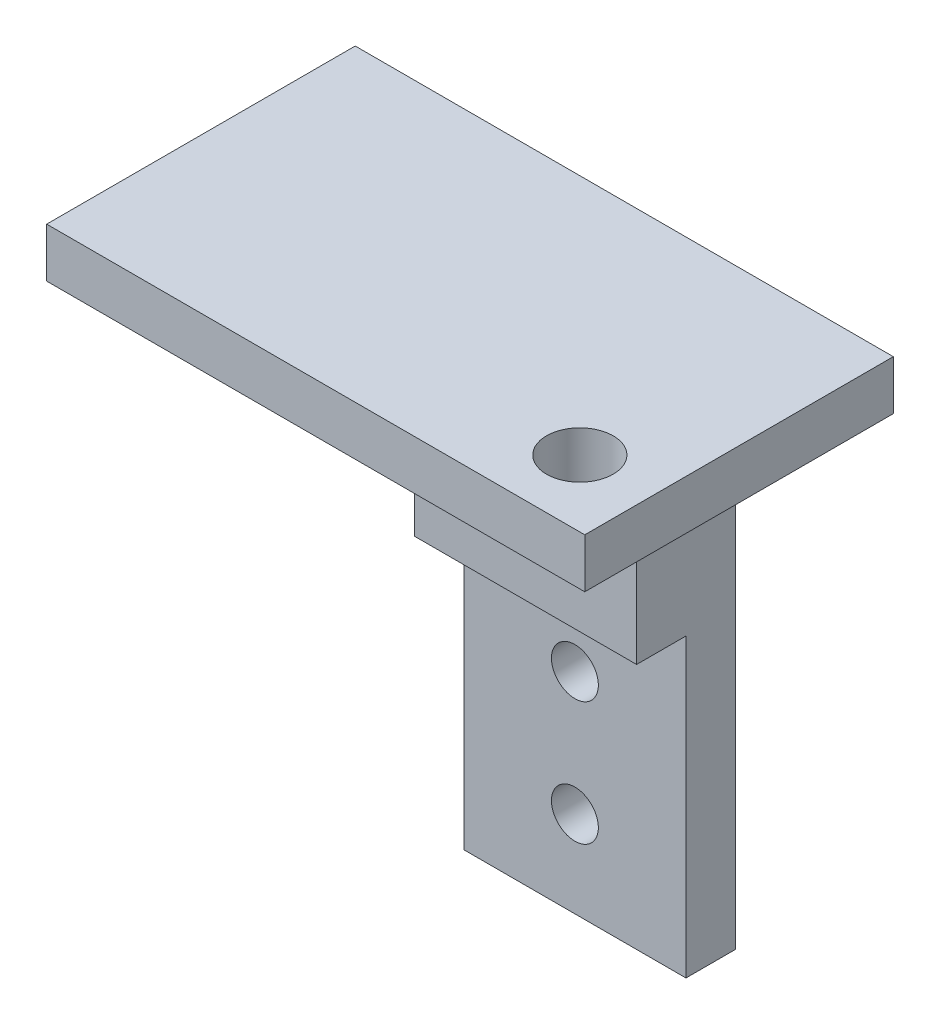
ISO-10303-21;
HEADER;
FILE_DESCRIPTION(('STEP AP214'),'2;1');
FILE_NAME('part.step','',(''),(''),'','','');
FILE_SCHEMA(('AUTOMOTIVE_DESIGN { 1 0 10303 214 1 1 1 1 }'));
ENDSEC;
DATA;
#1=APPLICATION_CONTEXT('core data for automotive mechanical design processes');
#2=APPLICATION_PROTOCOL_DEFINITION('international standard','automotive_design',2000,#1);
#3=PRODUCT_CONTEXT('',#1,'mechanical');
#4=PRODUCT('Part','Part','',(#3));
#5=PRODUCT_RELATED_PRODUCT_CATEGORY('part','',(#4));
#6=PRODUCT_DEFINITION_FORMATION('','',#4);
#7=PRODUCT_DEFINITION_CONTEXT('part definition',#1,'design');
#8=PRODUCT_DEFINITION('design','',#6,#7);
#9=PRODUCT_DEFINITION_SHAPE('','',#8);
#10=(LENGTH_UNIT() NAMED_UNIT(*) SI_UNIT(.MILLI.,.METRE.));
#11=(NAMED_UNIT(*) PLANE_ANGLE_UNIT() SI_UNIT($,.RADIAN.));
#12=(NAMED_UNIT(*) SI_UNIT($,.STERADIAN.) SOLID_ANGLE_UNIT());
#13=UNCERTAINTY_MEASURE_WITH_UNIT(LENGTH_MEASURE(1.E-05),#10,'distance_accuracy_value','');
#14=(GEOMETRIC_REPRESENTATION_CONTEXT(3) GLOBAL_UNCERTAINTY_ASSIGNED_CONTEXT((#13)) GLOBAL_UNIT_ASSIGNED_CONTEXT((#10,
#11,#12)) REPRESENTATION_CONTEXT('',''));
#15=CARTESIAN_POINT('',(0.,0.,0.));
#16=DIRECTION('',(0.,0.,1.));
#17=DIRECTION('',(1.,0.,0.));
#18=AXIS2_PLACEMENT_3D('',#15,#16,#17);
#19=CARTESIAN_POINT('',(0.,0.,0.));
#20=DIRECTION('',(0.,1.,0.));
#21=DIRECTION('',(0.,0.,1.));
#22=AXIS2_PLACEMENT_3D('',#19,#20,#21);
#23=PLANE('',#22);
#24=CARTESIAN_POINT('',(8.,0.,3.55));
#25=DIRECTION('',(0.,1.,0.));
#26=DIRECTION('',(0.,0.,1.));
#27=AXIS2_PLACEMENT_3D('',#24,#25,#26);
#28=CIRCLE('',#27,1.35);
#29=CARTESIAN_POINT('',(8.,0.,4.9));
#30=VERTEX_POINT('',#29);
#31=EDGE_CURVE('E150',#30,#30,#28,.F.);
#32=ORIENTED_EDGE('',*,*,#31,.F.);
#33=EDGE_LOOP('',(#32));
#34=FACE_BOUND('',#33,.T.);
#35=DIRECTION('',(0.,0.,-1.));
#36=VECTOR('',#35,1.);
#37=CARTESIAN_POINT('',(-4.5,0.,-6.25));
#38=LINE('',#37,#36);
#39=CARTESIAN_POINT('',(-4.5,0.,-2.25));
#40=VERTEX_POINT('',#39);
#41=CARTESIAN_POINT('',(-4.5,0.,-6.25));
#42=VERTEX_POINT('',#41);
#43=EDGE_CURVE('E50',#40,#42,#38,.T.);
#44=ORIENTED_EDGE('',*,*,#43,.F.);
#45=DIRECTION('',(-1.,0.,0.));
#46=VECTOR('',#45,1.);
#47=CARTESIAN_POINT('',(-4.5,0.,-2.25));
#48=LINE('',#47,#46);
#49=CARTESIAN_POINT('',(4.5,0.,-2.25));
#50=VERTEX_POINT('',#49);
#51=EDGE_CURVE('E142',#50,#40,#48,.T.);
#52=ORIENTED_EDGE('',*,*,#51,.F.);
#53=DIRECTION('',(0.,0.,1.));
#54=VECTOR('',#53,1.);
#55=CARTESIAN_POINT('',(4.5,0.,-6.25));
#56=LINE('',#55,#54);
#57=CARTESIAN_POINT('',(4.5,0.,-6.25));
#58=VERTEX_POINT('',#57);
#59=EDGE_CURVE('E58',#58,#50,#56,.T.);
#60=ORIENTED_EDGE('',*,*,#59,.F.);
#61=DIRECTION('',(-1.,0.,0.));
#62=VECTOR('',#61,1.);
#63=CARTESIAN_POINT('',(-10.9,0.,-6.25));
#64=LINE('',#63,#62);
#65=CARTESIAN_POINT('',(10.9,0.,-6.25));
#66=VERTEX_POINT('',#65);
#67=EDGE_CURVE('E190',#66,#58,#64,.T.);
#68=ORIENTED_EDGE('',*,*,#67,.F.);
#69=DIRECTION('',(0.,0.,-1.));
#70=VECTOR('',#69,1.);
#71=CARTESIAN_POINT('',(10.9,0.,-6.25));
#72=LINE('',#71,#70);
#73=CARTESIAN_POINT('',(10.9,0.,6.25));
#74=VERTEX_POINT('',#73);
#75=EDGE_CURVE('E175',#74,#66,#72,.T.);
#76=ORIENTED_EDGE('',*,*,#75,.F.);
#77=DIRECTION('',(1.,0.,0.));
#78=VECTOR('',#77,1.);
#79=CARTESIAN_POINT('',(-10.9,0.,6.25));
#80=LINE('',#79,#78);
#81=CARTESIAN_POINT('',(-10.9,0.,6.25));
#82=VERTEX_POINT('',#81);
#83=EDGE_CURVE('E180',#82,#74,#80,.T.);
#84=ORIENTED_EDGE('',*,*,#83,.F.);
#85=DIRECTION('',(0.,0.,1.));
#86=VECTOR('',#85,1.);
#87=CARTESIAN_POINT('',(-10.9,0.,-6.25));
#88=LINE('',#87,#86);
#89=CARTESIAN_POINT('',(-10.9,0.,-6.25));
#90=VERTEX_POINT('',#89);
#91=EDGE_CURVE('E193',#90,#82,#88,.T.);
#92=ORIENTED_EDGE('',*,*,#91,.F.);
#93=EDGE_CURVE('E189',#42,#90,#64,.T.);
#94=ORIENTED_EDGE('',*,*,#93,.F.);
#95=EDGE_LOOP('',(#44,#52,#60,#68,#76,#84,#92,#94));
#96=FACE_BOUND('',#95,.T.);
#97=ADVANCED_FACE('F33',(#34,#96),#23,.F.);
#98=CARTESIAN_POINT('',(-4.5,-22.,-4.25));
#99=DIRECTION('',(0.,0.,-1.));
#100=DIRECTION('',(-1.,0.,0.));
#101=AXIS2_PLACEMENT_3D('',#98,#99,#100);
#102=PLANE('',#101);
#103=CARTESIAN_POINT('',(0.,-18.5,-4.25));
#104=DIRECTION('',(0.,0.,-1.));
#105=DIRECTION('',(-1.,0.,0.));
#106=AXIS2_PLACEMENT_3D('',#103,#104,#105);
#107=CIRCLE('',#106,0.95);
#108=CARTESIAN_POINT('',(-0.95,-18.5,-4.25));
#109=VERTEX_POINT('',#108);
#110=EDGE_CURVE('E157',#109,#109,#107,.T.);
#111=ORIENTED_EDGE('',*,*,#110,.T.);
#112=EDGE_LOOP('',(#111));
#113=FACE_BOUND('',#112,.T.);
#114=CARTESIAN_POINT('',(0.,-13.5,-4.25));
#115=DIRECTION('',(0.,0.,-1.));
#116=DIRECTION('',(-1.,0.,0.));
#117=AXIS2_PLACEMENT_3D('',#114,#115,#116);
#118=CIRCLE('',#117,0.95);
#119=CARTESIAN_POINT('',(-0.95,-13.5,-4.25));
#120=VERTEX_POINT('',#119);
#121=EDGE_CURVE('E37',#120,#120,#118,.T.);
#122=ORIENTED_EDGE('',*,*,#121,.T.);
#123=EDGE_LOOP('',(#122));
#124=FACE_BOUND('',#123,.T.);
#125=DIRECTION('',(1.,0.,0.));
#126=VECTOR('',#125,1.);
#127=CARTESIAN_POINT('',(-4.5,-10.,-4.25));
#128=LINE('',#127,#126);
#129=CARTESIAN_POINT('',(-4.5,-10.,-4.25));
#130=VERTEX_POINT('',#129);
#131=CARTESIAN_POINT('',(4.5,-10.,-4.25));
#132=VERTEX_POINT('',#131);
#133=EDGE_CURVE('E117',#130,#132,#128,.T.);
#134=ORIENTED_EDGE('',*,*,#133,.F.);
#135=DIRECTION('',(0.,1.,0.));
#136=VECTOR('',#135,1.);
#137=CARTESIAN_POINT('',(-4.5,-22.,-4.25));
#138=LINE('',#137,#136);
#139=CARTESIAN_POINT('',(-4.5,-22.,-4.25));
#140=VERTEX_POINT('',#139);
#141=EDGE_CURVE('E123',#140,#130,#138,.T.);
#142=ORIENTED_EDGE('',*,*,#141,.F.);
#143=DIRECTION('',(-1.,0.,0.));
#144=VECTOR('',#143,1.);
#145=CARTESIAN_POINT('',(-4.5,-22.,-4.25));
#146=LINE('',#145,#144);
#147=CARTESIAN_POINT('',(4.5,-22.,-4.25));
#148=VERTEX_POINT('',#147);
#149=EDGE_CURVE('E119',#148,#140,#146,.T.);
#150=ORIENTED_EDGE('',*,*,#149,.F.);
#151=DIRECTION('',(0.,1.,0.));
#152=VECTOR('',#151,1.);
#153=CARTESIAN_POINT('',(4.5,-22.,-4.25));
#154=LINE('',#153,#152);
#155=EDGE_CURVE('E113',#148,#132,#154,.T.);
#156=ORIENTED_EDGE('',*,*,#155,.T.);
#157=EDGE_LOOP('',(#134,#142,#150,#156));
#158=FACE_BOUND('',#157,.T.);
#159=ADVANCED_FACE('F115',(#113,#124,#158),#102,.F.);
#160=CARTESIAN_POINT('',(10.9,2.,-6.25));
#161=DIRECTION('',(-1.,0.,0.));
#162=DIRECTION('',(0.,0.,1.));
#163=AXIS2_PLACEMENT_3D('',#160,#161,#162);
#164=PLANE('',#163);
#165=ORIENTED_EDGE('',*,*,#75,.T.);
#166=DIRECTION('',(0.,-1.,0.));
#167=VECTOR('',#166,1.);
#168=CARTESIAN_POINT('',(10.9,2.,-6.25));
#169=LINE('',#168,#167);
#170=CARTESIAN_POINT('',(10.9,2.,-6.25));
#171=VERTEX_POINT('',#170);
#172=EDGE_CURVE('E11',#171,#66,#169,.T.);
#173=ORIENTED_EDGE('',*,*,#172,.F.);
#174=DIRECTION('',(0.,0.,-1.));
#175=VECTOR('',#174,1.);
#176=CARTESIAN_POINT('',(10.9,2.,-6.25));
#177=LINE('',#176,#175);
#178=CARTESIAN_POINT('',(10.9,2.,6.25));
#179=VERTEX_POINT('',#178);
#180=EDGE_CURVE('E176',#179,#171,#177,.T.);
#181=ORIENTED_EDGE('',*,*,#180,.F.);
#182=DIRECTION('',(0.,-1.,0.));
#183=VECTOR('',#182,1.);
#184=CARTESIAN_POINT('',(10.9,2.,6.25));
#185=LINE('',#184,#183);
#186=EDGE_CURVE('E186',#179,#74,#185,.T.);
#187=ORIENTED_EDGE('',*,*,#186,.T.);
#188=EDGE_LOOP('',(#165,#173,#181,#187));
#189=FACE_BOUND('',#188,.T.);
#190=ADVANCED_FACE('F35',(#189),#164,.F.);
#191=CARTESIAN_POINT('',(-10.9,2.,-6.25));
#192=DIRECTION('',(0.,0.,1.));
#193=DIRECTION('',(1.,0.,0.));
#194=AXIS2_PLACEMENT_3D('',#191,#192,#193);
#195=PLANE('',#194);
#196=CARTESIAN_POINT('',(0.,-13.5,-6.25));
#197=DIRECTION('',(0.,0.,-1.));
#198=DIRECTION('',(-1.,0.,0.));
#199=AXIS2_PLACEMENT_3D('',#196,#197,#198);
#200=CIRCLE('',#199,0.95);
#201=CARTESIAN_POINT('',(-0.95,-13.5,-6.25));
#202=VERTEX_POINT('',#201);
#203=EDGE_CURVE('E154',#202,#202,#200,.T.);
#204=ORIENTED_EDGE('',*,*,#203,.F.);
#205=EDGE_LOOP('',(#204));
#206=FACE_BOUND('',#205,.T.);
#207=CARTESIAN_POINT('',(0.,-18.5,-6.25));
#208=DIRECTION('',(0.,0.,-1.));
#209=DIRECTION('',(-1.,0.,0.));
#210=AXIS2_PLACEMENT_3D('',#207,#208,#209);
#211=CIRCLE('',#210,0.95);
#212=CARTESIAN_POINT('',(-0.95,-18.5,-6.25));
#213=VERTEX_POINT('',#212);
#214=EDGE_CURVE('E153',#213,#213,#211,.T.);
#215=ORIENTED_EDGE('',*,*,#214,.F.);
#216=EDGE_LOOP('',(#215));
#217=FACE_BOUND('',#216,.T.);
#218=ORIENTED_EDGE('',*,*,#67,.T.);
#219=DIRECTION('',(0.,1.,0.));
#220=VECTOR('',#219,1.);
#221=CARTESIAN_POINT('',(4.5,-22.,-6.25));
#222=LINE('',#221,#220);
#223=CARTESIAN_POINT('',(4.5,-22.,-6.25));
#224=VERTEX_POINT('',#223);
#225=EDGE_CURVE('E122',#224,#58,#222,.T.);
#226=ORIENTED_EDGE('',*,*,#225,.F.);
#227=DIRECTION('',(1.,0.,0.));
#228=VECTOR('',#227,1.);
#229=CARTESIAN_POINT('',(-4.5,-22.,-6.25));
#230=LINE('',#229,#228);
#231=CARTESIAN_POINT('',(-4.5,-22.,-6.25));
#232=VERTEX_POINT('',#231);
#233=EDGE_CURVE('E163',#232,#224,#230,.T.);
#234=ORIENTED_EDGE('',*,*,#233,.F.);
#235=DIRECTION('',(0.,1.,0.));
#236=VECTOR('',#235,1.);
#237=CARTESIAN_POINT('',(-4.5,-22.,-6.25));
#238=LINE('',#237,#236);
#239=EDGE_CURVE('E172',#232,#42,#238,.T.);
#240=ORIENTED_EDGE('',*,*,#239,.T.);
#241=ORIENTED_EDGE('',*,*,#93,.T.);
#242=DIRECTION('',(0.,-1.,0.));
#243=VECTOR('',#242,1.);
#244=CARTESIAN_POINT('',(-10.9,2.,-6.25));
#245=LINE('',#244,#243);
#246=CARTESIAN_POINT('',(-10.9,2.,-6.25));
#247=VERTEX_POINT('',#246);
#248=EDGE_CURVE('E42',#247,#90,#245,.T.);
#249=ORIENTED_EDGE('',*,*,#248,.F.);
#250=DIRECTION('',(-1.,0.,0.));
#251=VECTOR('',#250,1.);
#252=CARTESIAN_POINT('',(-10.9,2.,-6.25));
#253=LINE('',#252,#251);
#254=EDGE_CURVE('E179',#171,#247,#253,.T.);
#255=ORIENTED_EDGE('',*,*,#254,.F.);
#256=ORIENTED_EDGE('',*,*,#172,.T.);
#257=EDGE_LOOP('',(#218,#226,#234,#240,#241,#249,#255,#256));
#258=FACE_BOUND('',#257,.T.);
#259=ADVANCED_FACE('F243',(#206,#217,#258),#195,.F.);
#260=CARTESIAN_POINT('',(-10.9,2.,-6.25));
#261=DIRECTION('',(1.,0.,0.));
#262=DIRECTION('',(0.,0.,-1.));
#263=AXIS2_PLACEMENT_3D('',#260,#261,#262);
#264=PLANE('',#263);
#265=ORIENTED_EDGE('',*,*,#91,.T.);
#266=DIRECTION('',(0.,-1.,0.));
#267=VECTOR('',#266,1.);
#268=CARTESIAN_POINT('',(-10.9,2.,6.25));
#269=LINE('',#268,#267);
#270=CARTESIAN_POINT('',(-10.9,2.,6.25));
#271=VERTEX_POINT('',#270);
#272=EDGE_CURVE('E198',#271,#82,#269,.T.);
#273=ORIENTED_EDGE('',*,*,#272,.F.);
#274=DIRECTION('',(0.,0.,1.));
#275=VECTOR('',#274,1.);
#276=CARTESIAN_POINT('',(-10.9,2.,-6.25));
#277=LINE('',#276,#275);
#278=EDGE_CURVE('E182',#247,#271,#277,.T.);
#279=ORIENTED_EDGE('',*,*,#278,.F.);
#280=ORIENTED_EDGE('',*,*,#248,.T.);
#281=EDGE_LOOP('',(#265,#273,#279,#280));
#282=FACE_BOUND('',#281,.T.);
#283=ADVANCED_FACE('F240',(#282),#264,.F.);
#284=CARTESIAN_POINT('',(-10.9,2.,6.25));
#285=DIRECTION('',(0.,0.,-1.));
#286=DIRECTION('',(-1.,0.,0.));
#287=AXIS2_PLACEMENT_3D('',#284,#285,#286);
#288=PLANE('',#287);
#289=ORIENTED_EDGE('',*,*,#83,.T.);
#290=ORIENTED_EDGE('',*,*,#186,.F.);
#291=DIRECTION('',(1.,0.,0.));
#292=VECTOR('',#291,1.);
#293=CARTESIAN_POINT('',(-10.9,2.,6.25));
#294=LINE('',#293,#292);
#295=EDGE_CURVE('E184',#271,#179,#294,.T.);
#296=ORIENTED_EDGE('',*,*,#295,.F.);
#297=ORIENTED_EDGE('',*,*,#272,.T.);
#298=EDGE_LOOP('',(#289,#290,#296,#297));
#299=FACE_BOUND('',#298,.T.);
#300=ADVANCED_FACE('F237',(#299),#288,.F.);
#301=CARTESIAN_POINT('',(0.,2.,0.));
#302=DIRECTION('',(0.,1.,0.));
#303=DIRECTION('',(0.,0.,1.));
#304=AXIS2_PLACEMENT_3D('',#301,#302,#303);
#305=PLANE('',#304);
#306=ORIENTED_EDGE('',*,*,#180,.T.);
#307=ORIENTED_EDGE('',*,*,#254,.T.);
#308=ORIENTED_EDGE('',*,*,#278,.T.);
#309=ORIENTED_EDGE('',*,*,#295,.T.);
#310=EDGE_LOOP('',(#306,#307,#308,#309));
#311=FACE_BOUND('',#310,.T.);
#312=CARTESIAN_POINT('',(8.,2.,3.55));
#313=DIRECTION('',(0.,1.,0.));
#314=DIRECTION('',(0.,0.,1.));
#315=AXIS2_PLACEMENT_3D('',#312,#313,#314);
#316=CIRCLE('',#315,1.35);
#317=CARTESIAN_POINT('',(8.,2.,4.9));
#318=VERTEX_POINT('',#317);
#319=EDGE_CURVE('E147',#318,#318,#316,.T.);
#320=ORIENTED_EDGE('',*,*,#319,.F.);
#321=EDGE_LOOP('',(#320));
#322=FACE_BOUND('',#321,.T.);
#323=ADVANCED_FACE('F235',(#311,#322),#305,.T.);
#324=CARTESIAN_POINT('',(-4.5,-22.,-6.25));
#325=DIRECTION('',(1.,0.,0.));
#326=DIRECTION('',(0.,0.,-1.));
#327=AXIS2_PLACEMENT_3D('',#324,#325,#326);
#328=PLANE('',#327);
#329=ORIENTED_EDGE('',*,*,#43,.T.);
#330=ORIENTED_EDGE('',*,*,#239,.F.);
#331=DIRECTION('',(0.,0.,-1.));
#332=VECTOR('',#331,1.);
#333=CARTESIAN_POINT('',(-4.5,-22.,-6.25));
#334=LINE('',#333,#332);
#335=EDGE_CURVE('E160',#140,#232,#334,.T.);
#336=ORIENTED_EDGE('',*,*,#335,.F.);
#337=ORIENTED_EDGE('',*,*,#141,.T.);
#338=DIRECTION('',(0.,0.,-1.));
#339=VECTOR('',#338,1.);
#340=CARTESIAN_POINT('',(-4.5,-10.,-4.25));
#341=LINE('',#340,#339);
#342=CARTESIAN_POINT('',(-4.5,-10.,-2.25));
#343=VERTEX_POINT('',#342);
#344=EDGE_CURVE('E130',#343,#130,#341,.T.);
#345=ORIENTED_EDGE('',*,*,#344,.F.);
#346=DIRECTION('',(0.,1.,0.));
#347=VECTOR('',#346,1.);
#348=CARTESIAN_POINT('',(-4.5,-10.,-2.25));
#349=LINE('',#348,#347);
#350=EDGE_CURVE('E138',#343,#40,#349,.T.);
#351=ORIENTED_EDGE('',*,*,#350,.T.);
#352=EDGE_LOOP('',(#329,#330,#336,#337,#345,#351));
#353=FACE_BOUND('',#352,.T.);
#354=ADVANCED_FACE('F263',(#353),#328,.F.);
#355=CARTESIAN_POINT('',(4.5,-22.,-6.25));
#356=DIRECTION('',(-1.,0.,0.));
#357=DIRECTION('',(0.,0.,1.));
#358=AXIS2_PLACEMENT_3D('',#355,#356,#357);
#359=PLANE('',#358);
#360=ORIENTED_EDGE('',*,*,#59,.T.);
#361=DIRECTION('',(0.,1.,0.));
#362=VECTOR('',#361,1.);
#363=CARTESIAN_POINT('',(4.5,-10.,-2.25));
#364=LINE('',#363,#362);
#365=CARTESIAN_POINT('',(4.5,-10.,-2.25));
#366=VERTEX_POINT('',#365);
#367=EDGE_CURVE('E134',#366,#50,#364,.T.);
#368=ORIENTED_EDGE('',*,*,#367,.F.);
#369=DIRECTION('',(0.,0.,1.));
#370=VECTOR('',#369,1.);
#371=CARTESIAN_POINT('',(4.5,-10.,-4.25));
#372=LINE('',#371,#370);
#373=EDGE_CURVE('E128',#132,#366,#372,.T.);
#374=ORIENTED_EDGE('',*,*,#373,.F.);
#375=ORIENTED_EDGE('',*,*,#155,.F.);
#376=DIRECTION('',(0.,0.,1.));
#377=VECTOR('',#376,1.);
#378=CARTESIAN_POINT('',(4.5,-22.,-6.25));
#379=LINE('',#378,#377);
#380=EDGE_CURVE('E165',#224,#148,#379,.T.);
#381=ORIENTED_EDGE('',*,*,#380,.F.);
#382=ORIENTED_EDGE('',*,*,#225,.T.);
#383=EDGE_LOOP('',(#360,#368,#374,#375,#381,#382));
#384=FACE_BOUND('',#383,.T.);
#385=ADVANCED_FACE('F132',(#384),#359,.F.);
#386=CARTESIAN_POINT('',(0.,-22.,0.));
#387=DIRECTION('',(0.,1.,0.));
#388=DIRECTION('',(0.,0.,1.));
#389=AXIS2_PLACEMENT_3D('',#386,#387,#388);
#390=PLANE('',#389);
#391=ORIENTED_EDGE('',*,*,#335,.T.);
#392=ORIENTED_EDGE('',*,*,#233,.T.);
#393=ORIENTED_EDGE('',*,*,#380,.T.);
#394=ORIENTED_EDGE('',*,*,#149,.T.);
#395=EDGE_LOOP('',(#391,#392,#393,#394));
#396=FACE_BOUND('',#395,.T.);
#397=ADVANCED_FACE('F222',(#396),#390,.F.);
#398=CARTESIAN_POINT('',(0.,-18.5,6.25));
#399=DIRECTION('',(0.,0.,-1.));
#400=DIRECTION('',(-1.,0.,0.));
#401=AXIS2_PLACEMENT_3D('',#398,#399,#400);
#402=CYLINDRICAL_SURFACE('',#401,0.95);
#403=ORIENTED_EDGE('',*,*,#214,.T.);
#404=EDGE_LOOP('',(#403));
#405=FACE_BOUND('',#404,.T.);
#406=ORIENTED_EDGE('',*,*,#110,.F.);
#407=EDGE_LOOP('',(#406));
#408=FACE_BOUND('',#407,.T.);
#409=ADVANCED_FACE('F212',(#405,#408),#402,.F.);
#410=CARTESIAN_POINT('',(0.,-13.5,6.25));
#411=DIRECTION('',(0.,0.,-1.));
#412=DIRECTION('',(-1.,0.,0.));
#413=AXIS2_PLACEMENT_3D('',#410,#411,#412);
#414=CYLINDRICAL_SURFACE('',#413,0.95);
#415=ORIENTED_EDGE('',*,*,#203,.T.);
#416=EDGE_LOOP('',(#415));
#417=FACE_BOUND('',#416,.T.);
#418=ORIENTED_EDGE('',*,*,#121,.F.);
#419=EDGE_LOOP('',(#418));
#420=FACE_BOUND('',#419,.T.);
#421=ADVANCED_FACE('F209',(#417,#420),#414,.F.);
#422=CARTESIAN_POINT('',(8.,-5.09116882454314,3.55));
#423=DIRECTION('',(0.,1.,0.));
#424=DIRECTION('',(0.,0.,1.));
#425=AXIS2_PLACEMENT_3D('',#422,#423,#424);
#426=CYLINDRICAL_SURFACE('',#425,1.35);
#427=ORIENTED_EDGE('',*,*,#31,.T.);
#428=EDGE_LOOP('',(#427));
#429=FACE_BOUND('',#428,.T.);
#430=ORIENTED_EDGE('',*,*,#319,.T.);
#431=EDGE_LOOP('',(#430));
#432=FACE_BOUND('',#431,.T.);
#433=ADVANCED_FACE('F211',(#429,#432),#426,.F.);
#434=CARTESIAN_POINT('',(-4.5,-10.,-2.25));
#435=DIRECTION('',(0.,0.,-1.));
#436=DIRECTION('',(-1.,0.,0.));
#437=AXIS2_PLACEMENT_3D('',#434,#435,#436);
#438=PLANE('',#437);
#439=ORIENTED_EDGE('',*,*,#51,.T.);
#440=ORIENTED_EDGE('',*,*,#350,.F.);
#441=DIRECTION('',(-1.,0.,0.));
#442=VECTOR('',#441,1.);
#443=CARTESIAN_POINT('',(-4.5,-10.,-2.25));
#444=LINE('',#443,#442);
#445=EDGE_CURVE('E136',#366,#343,#444,.T.);
#446=ORIENTED_EDGE('',*,*,#445,.F.);
#447=ORIENTED_EDGE('',*,*,#367,.T.);
#448=EDGE_LOOP('',(#439,#440,#446,#447));
#449=FACE_BOUND('',#448,.T.);
#450=ADVANCED_FACE('F219',(#449),#438,.F.);
#451=CARTESIAN_POINT('',(0.,-10.,0.));
#452=DIRECTION('',(0.,1.,0.));
#453=DIRECTION('',(0.,0.,1.));
#454=AXIS2_PLACEMENT_3D('',#451,#452,#453);
#455=PLANE('',#454);
#456=ORIENTED_EDGE('',*,*,#344,.T.);
#457=ORIENTED_EDGE('',*,*,#133,.T.);
#458=ORIENTED_EDGE('',*,*,#373,.T.);
#459=ORIENTED_EDGE('',*,*,#445,.T.);
#460=EDGE_LOOP('',(#456,#457,#458,#459));
#461=FACE_BOUND('',#460,.T.);
#462=ADVANCED_FACE('F127',(#461),#455,.F.);
#463=CLOSED_SHELL('',(#97,#159,#190,#259,#283,#300,#323,#354,#385,#397,#409,#421,#433,#450,#462));
#464=MANIFOLD_SOLID_BREP('B2',#463);
#465=ADVANCED_BREP_SHAPE_REPRESENTATION('',(#18,#464),#14);
#466=SHAPE_DEFINITION_REPRESENTATION(#9,#465);
ENDSEC;
END-ISO-10303-21;
